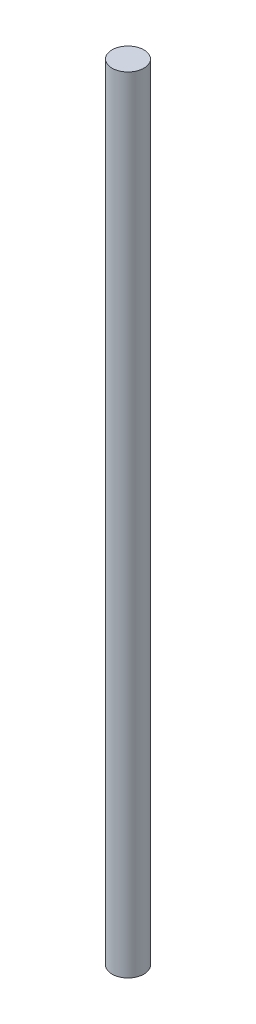
ISO-10303-21;
HEADER;
FILE_DESCRIPTION(('STEP AP214'),'2;1');
FILE_NAME('part.step','',(''),(''),'','','');
FILE_SCHEMA(('AUTOMOTIVE_DESIGN { 1 0 10303 214 1 1 1 1 }'));
ENDSEC;
DATA;
#1=APPLICATION_CONTEXT('core data for automotive mechanical design processes');
#2=APPLICATION_PROTOCOL_DEFINITION('international standard','automotive_design',2000,#1);
#3=PRODUCT_CONTEXT('',#1,'mechanical');
#4=PRODUCT('Part','Part','',(#3));
#5=PRODUCT_RELATED_PRODUCT_CATEGORY('part','',(#4));
#6=PRODUCT_DEFINITION_FORMATION('','',#4);
#7=PRODUCT_DEFINITION_CONTEXT('part definition',#1,'design');
#8=PRODUCT_DEFINITION('design','',#6,#7);
#9=PRODUCT_DEFINITION_SHAPE('','',#8);
#10=(LENGTH_UNIT() NAMED_UNIT(*) SI_UNIT(.MILLI.,.METRE.));
#11=(NAMED_UNIT(*) PLANE_ANGLE_UNIT() SI_UNIT($,.RADIAN.));
#12=(NAMED_UNIT(*) SI_UNIT($,.STERADIAN.) SOLID_ANGLE_UNIT());
#13=UNCERTAINTY_MEASURE_WITH_UNIT(LENGTH_MEASURE(1.E-05),#10,'distance_accuracy_value','');
#14=(GEOMETRIC_REPRESENTATION_CONTEXT(3) GLOBAL_UNCERTAINTY_ASSIGNED_CONTEXT((#13)) GLOBAL_UNIT_ASSIGNED_CONTEXT((#10,
#11,#12)) REPRESENTATION_CONTEXT('',''));
#15=CARTESIAN_POINT('',(0.,0.,0.));
#16=DIRECTION('',(0.,0.,1.));
#17=DIRECTION('',(1.,0.,0.));
#18=AXIS2_PLACEMENT_3D('',#15,#16,#17);
#19=CARTESIAN_POINT('',(0.,74.,0.));
#20=DIRECTION('',(0.,-1.,0.));
#21=DIRECTION('',(0.,0.,-1.));
#22=AXIS2_PLACEMENT_3D('',#19,#20,#21);
#23=CYLINDRICAL_SURFACE('',#22,1.5);
#24=CARTESIAN_POINT('',(0.,74.,0.));
#25=DIRECTION('',(0.,1.,0.));
#26=DIRECTION('',(0.,0.,1.));
#27=AXIS2_PLACEMENT_3D('',#24,#25,#26);
#28=CIRCLE('',#27,1.5);
#29=CARTESIAN_POINT('',(0.,74.,1.5));
#30=VERTEX_POINT('',#29);
#31=EDGE_CURVE('E10',#30,#30,#28,.T.);
#32=ORIENTED_EDGE('',*,*,#31,.F.);
#33=EDGE_LOOP('',(#32));
#34=FACE_BOUND('',#33,.T.);
#35=CARTESIAN_POINT('',(0.,0.,0.));
#36=DIRECTION('',(0.,1.,0.));
#37=DIRECTION('',(0.,0.,1.));
#38=AXIS2_PLACEMENT_3D('',#35,#36,#37);
#39=CIRCLE('',#38,1.5);
#40=CARTESIAN_POINT('',(0.,0.,1.5));
#41=VERTEX_POINT('',#40);
#42=EDGE_CURVE('E34',#41,#41,#39,.T.);
#43=ORIENTED_EDGE('',*,*,#42,.T.);
#44=EDGE_LOOP('',(#43));
#45=FACE_BOUND('',#44,.T.);
#46=ADVANCED_FACE('F31',(#34,#45),#23,.T.);
#47=CARTESIAN_POINT('',(0.,74.,0.));
#48=DIRECTION('',(0.,1.,0.));
#49=DIRECTION('',(0.,0.,1.));
#50=AXIS2_PLACEMENT_3D('',#47,#48,#49);
#51=PLANE('',#50);
#52=ORIENTED_EDGE('',*,*,#31,.T.);
#53=EDGE_LOOP('',(#52));
#54=FACE_BOUND('',#53,.T.);
#55=ADVANCED_FACE('F46',(#54),#51,.T.);
#56=CARTESIAN_POINT('',(0.,0.,0.));
#57=DIRECTION('',(0.,1.,0.));
#58=DIRECTION('',(0.,0.,1.));
#59=AXIS2_PLACEMENT_3D('',#56,#57,#58);
#60=PLANE('',#59);
#61=ORIENTED_EDGE('',*,*,#42,.F.);
#62=EDGE_LOOP('',(#61));
#63=FACE_BOUND('',#62,.T.);
#64=ADVANCED_FACE('F44',(#63),#60,.F.);
#65=CLOSED_SHELL('',(#46,#55,#64));
#66=MANIFOLD_SOLID_BREP('B2',#65);
#67=ADVANCED_BREP_SHAPE_REPRESENTATION('',(#18,#66),#14);
#68=SHAPE_DEFINITION_REPRESENTATION(#9,#67);
ENDSEC;
END-ISO-10303-21;
